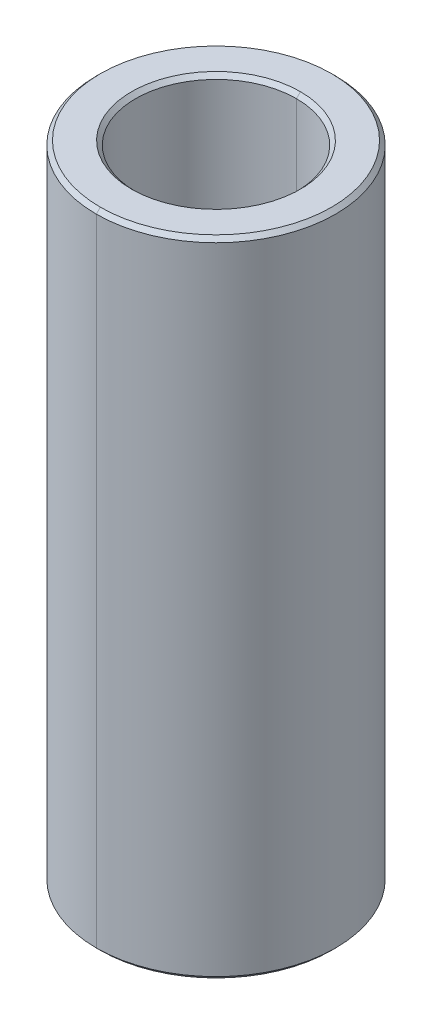
ISO-10303-21;
HEADER;
FILE_DESCRIPTION(('STEP AP214'),'2;1');
FILE_NAME('part.step','',(''),(''),'','','');
FILE_SCHEMA(('AUTOMOTIVE_DESIGN { 1 0 10303 214 1 1 1 1 }'));
ENDSEC;
DATA;
#1=APPLICATION_CONTEXT('core data for automotive mechanical design processes');
#2=APPLICATION_PROTOCOL_DEFINITION('international standard','automotive_design',2000,#1);
#3=PRODUCT_CONTEXT('',#1,'mechanical');
#4=PRODUCT('Part','Part','',(#3));
#5=PRODUCT_RELATED_PRODUCT_CATEGORY('part','',(#4));
#6=PRODUCT_DEFINITION_FORMATION('','',#4);
#7=PRODUCT_DEFINITION_CONTEXT('part definition',#1,'design');
#8=PRODUCT_DEFINITION('design','',#6,#7);
#9=PRODUCT_DEFINITION_SHAPE('','',#8);
#10=(LENGTH_UNIT() NAMED_UNIT(*) SI_UNIT(.MILLI.,.METRE.));
#11=(NAMED_UNIT(*) PLANE_ANGLE_UNIT() SI_UNIT($,.RADIAN.));
#12=(NAMED_UNIT(*) SI_UNIT($,.STERADIAN.) SOLID_ANGLE_UNIT());
#13=UNCERTAINTY_MEASURE_WITH_UNIT(LENGTH_MEASURE(1.E-05),#10,'distance_accuracy_value','');
#14=(GEOMETRIC_REPRESENTATION_CONTEXT(3) GLOBAL_UNCERTAINTY_ASSIGNED_CONTEXT((#13)) GLOBAL_UNIT_ASSIGNED_CONTEXT((#10,
#11,#12)) REPRESENTATION_CONTEXT('',''));
#15=CARTESIAN_POINT('',(0.,0.,0.));
#16=DIRECTION('',(0.,0.,1.));
#17=DIRECTION('',(1.,0.,0.));
#18=AXIS2_PLACEMENT_3D('',#15,#16,#17);
#19=CARTESIAN_POINT('',(0.,7.9,0.));
#20=DIRECTION('',(0.,1.,0.));
#21=DIRECTION('',(0.,0.,1.));
#22=AXIS2_PLACEMENT_3D('',#19,#20,#21);
#23=CONICAL_SURFACE('',#22,2.,0.78539816339744);
#24=DIRECTION('',(0.,0.707106781186554,-0.707106781186542));
#25=VECTOR('',#24,1.);
#26=CARTESIAN_POINT('',(0.,7.9,-2.));
#27=LINE('',#26,#25);
#28=CARTESIAN_POINT('',(0.,7.9,-2.));
#29=VERTEX_POINT('',#28);
#30=CARTESIAN_POINT('',(0.,8.,-2.1));
#31=VERTEX_POINT('',#30);
#32=EDGE_CURVE('E177',#29,#31,#27,.T.);
#33=ORIENTED_EDGE('',*,*,#32,.F.);
#34=CARTESIAN_POINT('',(0.,7.9,0.));
#35=DIRECTION('',(0.,1.,0.));
#36=DIRECTION('',(0.,0.,1.));
#37=AXIS2_PLACEMENT_3D('',#34,#35,#36);
#38=CIRCLE('',#37,2.);
#39=CARTESIAN_POINT('',(0.,7.9,2.));
#40=VERTEX_POINT('',#39);
#41=EDGE_CURVE('E27',#40,#29,#38,.T.);
#42=ORIENTED_EDGE('',*,*,#41,.F.);
#43=DIRECTION('',(0.,0.707106781186554,0.707106781186542));
#44=VECTOR('',#43,1.);
#45=CARTESIAN_POINT('',(0.,7.9,2.));
#46=LINE('',#45,#44);
#47=CARTESIAN_POINT('',(0.,8.,2.1));
#48=VERTEX_POINT('',#47);
#49=EDGE_CURVE('E185',#40,#48,#46,.T.);
#50=ORIENTED_EDGE('',*,*,#49,.T.);
#51=CARTESIAN_POINT('',(0.,8.,0.));
#52=DIRECTION('',(0.,-1.,0.));
#53=DIRECTION('',(0.,0.,1.));
#54=AXIS2_PLACEMENT_3D('',#51,#52,#53);
#55=CIRCLE('',#54,2.1);
#56=EDGE_CURVE('E122',#31,#48,#55,.T.);
#57=ORIENTED_EDGE('',*,*,#56,.F.);
#58=EDGE_LOOP('',(#33,#42,#50,#57));
#59=FACE_BOUND('',#58,.T.);
#60=ADVANCED_FACE('F16',(#59),#23,.F.);
#61=CARTESIAN_POINT('',(0.,-8.,0.));
#62=DIRECTION('',(0.,-1.,0.));
#63=DIRECTION('',(0.,0.,-1.));
#64=AXIS2_PLACEMENT_3D('',#61,#62,#63);
#65=CONICAL_SURFACE('',#64,2.1,0.78539816339744);
#66=DIRECTION('',(0.,-0.707106781186554,0.707106781186542));
#67=VECTOR('',#66,1.);
#68=CARTESIAN_POINT('',(0.,-8.,2.1));
#69=LINE('',#68,#67);
#70=CARTESIAN_POINT('',(0.,-7.9,2.));
#71=VERTEX_POINT('',#70);
#72=CARTESIAN_POINT('',(0.,-8.,2.1));
#73=VERTEX_POINT('',#72);
#74=EDGE_CURVE('E145',#71,#73,#69,.T.);
#75=ORIENTED_EDGE('',*,*,#74,.F.);
#76=CARTESIAN_POINT('',(0.,-7.9,0.));
#77=DIRECTION('',(0.,-1.,0.));
#78=DIRECTION('',(0.,0.,1.));
#79=AXIS2_PLACEMENT_3D('',#76,#77,#78);
#80=CIRCLE('',#79,2.);
#81=CARTESIAN_POINT('',(0.,-7.9,-2.));
#82=VERTEX_POINT('',#81);
#83=EDGE_CURVE('E10',#82,#71,#80,.T.);
#84=ORIENTED_EDGE('',*,*,#83,.F.);
#85=DIRECTION('',(0.,-0.707106781186554,-0.707106781186542));
#86=VECTOR('',#85,1.);
#87=CARTESIAN_POINT('',(0.,-8.,-2.1));
#88=LINE('',#87,#86);
#89=CARTESIAN_POINT('',(0.,-8.,-2.1));
#90=VERTEX_POINT('',#89);
#91=EDGE_CURVE('E213',#82,#90,#88,.T.);
#92=ORIENTED_EDGE('',*,*,#91,.T.);
#93=CARTESIAN_POINT('',(0.,-8.,0.));
#94=DIRECTION('',(0.,1.,0.));
#95=DIRECTION('',(0.,0.,1.));
#96=AXIS2_PLACEMENT_3D('',#93,#94,#95);
#97=CIRCLE('',#96,2.1);
#98=EDGE_CURVE('E59',#73,#90,#97,.T.);
#99=ORIENTED_EDGE('',*,*,#98,.F.);
#100=EDGE_LOOP('',(#75,#84,#92,#99));
#101=FACE_BOUND('',#100,.T.);
#102=ADVANCED_FACE('F226',(#101),#65,.F.);
#103=CARTESIAN_POINT('',(0.,8.,0.));
#104=DIRECTION('',(0.,-1.,0.));
#105=DIRECTION('',(0.,0.,-1.));
#106=AXIS2_PLACEMENT_3D('',#103,#104,#105);
#107=CONICAL_SURFACE('',#106,2.875,0.78539816339744);
#108=DIRECTION('',(0.,-0.707106781186554,0.707106781186542));
#109=VECTOR('',#108,1.);
#110=CARTESIAN_POINT('',(0.,8.,2.875));
#111=LINE('',#110,#109);
#112=CARTESIAN_POINT('',(0.,8.,2.875));
#113=VERTEX_POINT('',#112);
#114=CARTESIAN_POINT('',(0.,7.9,2.975));
#115=VERTEX_POINT('',#114);
#116=EDGE_CURVE('E155',#113,#115,#111,.T.);
#117=ORIENTED_EDGE('',*,*,#116,.F.);
#118=CARTESIAN_POINT('',(0.,8.,0.));
#119=DIRECTION('',(0.,1.,0.));
#120=DIRECTION('',(0.,0.,1.));
#121=AXIS2_PLACEMENT_3D('',#118,#119,#120);
#122=CIRCLE('',#121,2.875);
#123=CARTESIAN_POINT('',(0.,8.,-2.875));
#124=VERTEX_POINT('',#123);
#125=EDGE_CURVE('E96',#124,#113,#122,.T.);
#126=ORIENTED_EDGE('',*,*,#125,.F.);
#127=DIRECTION('',(0.,-0.707106781186554,-0.707106781186542));
#128=VECTOR('',#127,1.);
#129=CARTESIAN_POINT('',(0.,8.,-2.875));
#130=LINE('',#129,#128);
#131=CARTESIAN_POINT('',(0.,7.9,-2.975));
#132=VERTEX_POINT('',#131);
#133=EDGE_CURVE('E134',#124,#132,#130,.T.);
#134=ORIENTED_EDGE('',*,*,#133,.T.);
#135=CARTESIAN_POINT('',(0.,7.9,0.));
#136=DIRECTION('',(0.,-1.,0.));
#137=DIRECTION('',(0.,0.,1.));
#138=AXIS2_PLACEMENT_3D('',#135,#136,#137);
#139=CIRCLE('',#138,2.975);
#140=EDGE_CURVE('E88',#115,#132,#139,.T.);
#141=ORIENTED_EDGE('',*,*,#140,.F.);
#142=EDGE_LOOP('',(#117,#126,#134,#141));
#143=FACE_BOUND('',#142,.T.);
#144=ADVANCED_FACE('F260',(#143),#107,.T.);
#145=CARTESIAN_POINT('',(0.,-7.9,0.));
#146=DIRECTION('',(0.,1.,0.));
#147=DIRECTION('',(0.,0.,1.));
#148=AXIS2_PLACEMENT_3D('',#145,#146,#147);
#149=CONICAL_SURFACE('',#148,2.975,0.78539816339744);
#150=DIRECTION('',(0.,0.707106781186554,-0.707106781186542));
#151=VECTOR('',#150,1.);
#152=CARTESIAN_POINT('',(0.,-7.9,-2.975));
#153=LINE('',#152,#151);
#154=CARTESIAN_POINT('',(0.,-8.,-2.875));
#155=VERTEX_POINT('',#154);
#156=CARTESIAN_POINT('',(0.,-7.9,-2.975));
#157=VERTEX_POINT('',#156);
#158=EDGE_CURVE('E124',#155,#157,#153,.T.);
#159=ORIENTED_EDGE('',*,*,#158,.F.);
#160=CARTESIAN_POINT('',(0.,-8.,0.));
#161=DIRECTION('',(0.,-1.,0.));
#162=DIRECTION('',(0.,0.,1.));
#163=AXIS2_PLACEMENT_3D('',#160,#161,#162);
#164=CIRCLE('',#163,2.875);
#165=CARTESIAN_POINT('',(0.,-8.,2.875));
#166=VERTEX_POINT('',#165);
#167=EDGE_CURVE('E20',#166,#155,#164,.T.);
#168=ORIENTED_EDGE('',*,*,#167,.F.);
#169=DIRECTION('',(0.,0.707106781186554,0.707106781186542));
#170=VECTOR('',#169,1.);
#171=CARTESIAN_POINT('',(0.,-7.9,2.975));
#172=LINE('',#171,#170);
#173=CARTESIAN_POINT('',(0.,-7.9,2.975));
#174=VERTEX_POINT('',#173);
#175=EDGE_CURVE('E132',#166,#174,#172,.T.);
#176=ORIENTED_EDGE('',*,*,#175,.T.);
#177=CARTESIAN_POINT('',(0.,-7.9,0.));
#178=DIRECTION('',(0.,1.,0.));
#179=DIRECTION('',(0.,0.,1.));
#180=AXIS2_PLACEMENT_3D('',#177,#178,#179);
#181=CIRCLE('',#180,2.975);
#182=EDGE_CURVE('E42',#157,#174,#181,.T.);
#183=ORIENTED_EDGE('',*,*,#182,.F.);
#184=EDGE_LOOP('',(#159,#168,#176,#183));
#185=FACE_BOUND('',#184,.T.);
#186=ADVANCED_FACE('F125',(#185),#149,.T.);
#187=CARTESIAN_POINT('',(0.,8.,0.));
#188=DIRECTION('',(0.,-1.,0.));
#189=DIRECTION('',(0.,0.,-1.));
#190=AXIS2_PLACEMENT_3D('',#187,#188,#189);
#191=CYLINDRICAL_SURFACE('',#190,2.);
#192=DIRECTION('',(0.,-1.,0.));
#193=VECTOR('',#192,1.);
#194=CARTESIAN_POINT('',(0.,8.,2.));
#195=LINE('',#194,#193);
#196=EDGE_CURVE('E181',#40,#71,#195,.T.);
#197=ORIENTED_EDGE('',*,*,#196,.F.);
#198=ORIENTED_EDGE('',*,*,#41,.T.);
#199=DIRECTION('',(0.,-1.,0.));
#200=VECTOR('',#199,1.);
#201=CARTESIAN_POINT('',(0.,8.,-2.));
#202=LINE('',#201,#200);
#203=EDGE_CURVE('E150',#29,#82,#202,.T.);
#204=ORIENTED_EDGE('',*,*,#203,.T.);
#205=ORIENTED_EDGE('',*,*,#83,.T.);
#206=EDGE_LOOP('',(#197,#198,#204,#205));
#207=FACE_BOUND('',#206,.T.);
#208=ADVANCED_FACE('F240',(#207),#191,.F.);
#209=CARTESIAN_POINT('',(0.,8.,0.));
#210=DIRECTION('',(0.,-1.,0.));
#211=DIRECTION('',(0.,0.,-1.));
#212=AXIS2_PLACEMENT_3D('',#209,#210,#211);
#213=CYLINDRICAL_SURFACE('',#212,2.975);
#214=DIRECTION('',(0.,-1.,0.));
#215=VECTOR('',#214,1.);
#216=CARTESIAN_POINT('',(0.,8.,2.975));
#217=LINE('',#216,#215);
#218=EDGE_CURVE('E147',#115,#174,#217,.T.);
#219=ORIENTED_EDGE('',*,*,#218,.F.);
#220=ORIENTED_EDGE('',*,*,#140,.T.);
#221=DIRECTION('',(0.,-1.,0.));
#222=VECTOR('',#221,1.);
#223=CARTESIAN_POINT('',(0.,8.,-2.975));
#224=LINE('',#223,#222);
#225=EDGE_CURVE('E149',#132,#157,#224,.T.);
#226=ORIENTED_EDGE('',*,*,#225,.T.);
#227=ORIENTED_EDGE('',*,*,#182,.T.);
#228=EDGE_LOOP('',(#219,#220,#226,#227));
#229=FACE_BOUND('',#228,.T.);
#230=ADVANCED_FACE('F263',(#229),#213,.T.);
#231=CARTESIAN_POINT('',(0.,-8.,0.));
#232=DIRECTION('',(0.,1.,0.));
#233=DIRECTION('',(1.,0.,0.));
#234=AXIS2_PLACEMENT_3D('',#231,#232,#233);
#235=PLANE('',#234);
#236=CARTESIAN_POINT('',(0.,-8.,0.));
#237=DIRECTION('',(0.,1.,0.));
#238=DIRECTION('',(0.,0.,1.));
#239=AXIS2_PLACEMENT_3D('',#236,#237,#238);
#240=CIRCLE('',#239,2.1);
#241=EDGE_CURVE('E212',#90,#73,#240,.T.);
#242=ORIENTED_EDGE('',*,*,#241,.T.);
#243=ORIENTED_EDGE('',*,*,#98,.T.);
#244=EDGE_LOOP('',(#242,#243));
#245=FACE_BOUND('',#244,.T.);
#246=ORIENTED_EDGE('',*,*,#167,.T.);
#247=CARTESIAN_POINT('',(0.,-8.,0.));
#248=DIRECTION('',(0.,-1.,0.));
#249=DIRECTION('',(0.,0.,1.));
#250=AXIS2_PLACEMENT_3D('',#247,#248,#249);
#251=CIRCLE('',#250,2.875);
#252=EDGE_CURVE('E120',#155,#166,#251,.T.);
#253=ORIENTED_EDGE('',*,*,#252,.T.);
#254=EDGE_LOOP('',(#246,#253));
#255=FACE_BOUND('',#254,.T.);
#256=ADVANCED_FACE('F118',(#245,#255),#235,.F.);
#257=CARTESIAN_POINT('',(0.,8.,0.));
#258=DIRECTION('',(0.,1.,0.));
#259=DIRECTION('',(1.,0.,0.));
#260=AXIS2_PLACEMENT_3D('',#257,#258,#259);
#261=PLANE('',#260);
#262=CARTESIAN_POINT('',(0.,8.,0.));
#263=DIRECTION('',(0.,-1.,0.));
#264=DIRECTION('',(0.,0.,1.));
#265=AXIS2_PLACEMENT_3D('',#262,#263,#264);
#266=CIRCLE('',#265,2.1);
#267=EDGE_CURVE('E186',#48,#31,#266,.T.);
#268=ORIENTED_EDGE('',*,*,#267,.T.);
#269=ORIENTED_EDGE('',*,*,#56,.T.);
#270=EDGE_LOOP('',(#268,#269));
#271=FACE_BOUND('',#270,.T.);
#272=ORIENTED_EDGE('',*,*,#125,.T.);
#273=CARTESIAN_POINT('',(0.,8.,0.));
#274=DIRECTION('',(0.,1.,0.));
#275=DIRECTION('',(0.,0.,1.));
#276=AXIS2_PLACEMENT_3D('',#273,#274,#275);
#277=CIRCLE('',#276,2.875);
#278=EDGE_CURVE('E219',#113,#124,#277,.T.);
#279=ORIENTED_EDGE('',*,*,#278,.T.);
#280=EDGE_LOOP('',(#272,#279));
#281=FACE_BOUND('',#280,.T.);
#282=ADVANCED_FACE('F268',(#271,#281),#261,.T.);
#283=CARTESIAN_POINT('',(0.,8.,0.));
#284=DIRECTION('',(0.,-1.,0.));
#285=DIRECTION('',(0.,0.,-1.));
#286=AXIS2_PLACEMENT_3D('',#283,#284,#285);
#287=CYLINDRICAL_SURFACE('',#286,2.975);
#288=CARTESIAN_POINT('',(0.,7.9,0.));
#289=DIRECTION('',(0.,-1.,0.));
#290=DIRECTION('',(0.,0.,1.));
#291=AXIS2_PLACEMENT_3D('',#288,#289,#290);
#292=CIRCLE('',#291,2.975);
#293=EDGE_CURVE('E141',#132,#115,#292,.T.);
#294=ORIENTED_EDGE('',*,*,#293,.T.);
#295=ORIENTED_EDGE('',*,*,#218,.T.);
#296=CARTESIAN_POINT('',(0.,-7.9,0.));
#297=DIRECTION('',(0.,1.,0.));
#298=DIRECTION('',(0.,0.,1.));
#299=AXIS2_PLACEMENT_3D('',#296,#297,#298);
#300=CIRCLE('',#299,2.975);
#301=EDGE_CURVE('E129',#174,#157,#300,.T.);
#302=ORIENTED_EDGE('',*,*,#301,.T.);
#303=ORIENTED_EDGE('',*,*,#225,.F.);
#304=EDGE_LOOP('',(#294,#295,#302,#303));
#305=FACE_BOUND('',#304,.T.);
#306=ADVANCED_FACE('F271',(#305),#287,.T.);
#307=CARTESIAN_POINT('',(0.,8.,0.));
#308=DIRECTION('',(0.,-1.,0.));
#309=DIRECTION('',(0.,0.,-1.));
#310=AXIS2_PLACEMENT_3D('',#307,#308,#309);
#311=CYLINDRICAL_SURFACE('',#310,2.);
#312=CARTESIAN_POINT('',(0.,7.9,0.));
#313=DIRECTION('',(0.,1.,0.));
#314=DIRECTION('',(0.,0.,1.));
#315=AXIS2_PLACEMENT_3D('',#312,#313,#314);
#316=CIRCLE('',#315,2.);
#317=EDGE_CURVE('E194',#29,#40,#316,.T.);
#318=ORIENTED_EDGE('',*,*,#317,.T.);
#319=ORIENTED_EDGE('',*,*,#196,.T.);
#320=CARTESIAN_POINT('',(0.,-7.9,0.));
#321=DIRECTION('',(0.,-1.,0.));
#322=DIRECTION('',(0.,0.,1.));
#323=AXIS2_PLACEMENT_3D('',#320,#321,#322);
#324=CIRCLE('',#323,2.);
#325=EDGE_CURVE('E182',#71,#82,#324,.T.);
#326=ORIENTED_EDGE('',*,*,#325,.T.);
#327=ORIENTED_EDGE('',*,*,#203,.F.);
#328=EDGE_LOOP('',(#318,#319,#326,#327));
#329=FACE_BOUND('',#328,.T.);
#330=ADVANCED_FACE('F245',(#329),#311,.F.);
#331=CARTESIAN_POINT('',(0.,-7.9,0.));
#332=DIRECTION('',(0.,1.,0.));
#333=DIRECTION('',(0.,0.,1.));
#334=AXIS2_PLACEMENT_3D('',#331,#332,#333);
#335=CONICAL_SURFACE('',#334,2.975,0.78539816339744);
#336=ORIENTED_EDGE('',*,*,#252,.F.);
#337=ORIENTED_EDGE('',*,*,#158,.T.);
#338=ORIENTED_EDGE('',*,*,#301,.F.);
#339=ORIENTED_EDGE('',*,*,#175,.F.);
#340=EDGE_LOOP('',(#336,#337,#338,#339));
#341=FACE_BOUND('',#340,.T.);
#342=ADVANCED_FACE('F131',(#341),#335,.T.);
#343=CARTESIAN_POINT('',(0.,8.,0.));
#344=DIRECTION('',(0.,-1.,0.));
#345=DIRECTION('',(0.,0.,-1.));
#346=AXIS2_PLACEMENT_3D('',#343,#344,#345);
#347=CONICAL_SURFACE('',#346,2.875,0.78539816339744);
#348=ORIENTED_EDGE('',*,*,#278,.F.);
#349=ORIENTED_EDGE('',*,*,#116,.T.);
#350=ORIENTED_EDGE('',*,*,#293,.F.);
#351=ORIENTED_EDGE('',*,*,#133,.F.);
#352=EDGE_LOOP('',(#348,#349,#350,#351));
#353=FACE_BOUND('',#352,.T.);
#354=ADVANCED_FACE('F18',(#353),#347,.T.);
#355=CARTESIAN_POINT('',(0.,-8.,0.));
#356=DIRECTION('',(0.,-1.,0.));
#357=DIRECTION('',(0.,0.,-1.));
#358=AXIS2_PLACEMENT_3D('',#355,#356,#357);
#359=CONICAL_SURFACE('',#358,2.1,0.78539816339744);
#360=ORIENTED_EDGE('',*,*,#325,.F.);
#361=ORIENTED_EDGE('',*,*,#74,.T.);
#362=ORIENTED_EDGE('',*,*,#241,.F.);
#363=ORIENTED_EDGE('',*,*,#91,.F.);
#364=EDGE_LOOP('',(#360,#361,#362,#363));
#365=FACE_BOUND('',#364,.T.);
#366=ADVANCED_FACE('F224',(#365),#359,.F.);
#367=CARTESIAN_POINT('',(0.,7.9,0.));
#368=DIRECTION('',(0.,1.,0.));
#369=DIRECTION('',(0.,0.,1.));
#370=AXIS2_PLACEMENT_3D('',#367,#368,#369);
#371=CONICAL_SURFACE('',#370,2.,0.78539816339744);
#372=ORIENTED_EDGE('',*,*,#317,.F.);
#373=ORIENTED_EDGE('',*,*,#32,.T.);
#374=ORIENTED_EDGE('',*,*,#267,.F.);
#375=ORIENTED_EDGE('',*,*,#49,.F.);
#376=EDGE_LOOP('',(#372,#373,#374,#375));
#377=FACE_BOUND('',#376,.T.);
#378=ADVANCED_FACE('F246',(#377),#371,.F.);
#379=CLOSED_SHELL('',(#60,#102,#144,#186,#208,#230,#256,#282,#306,#330,#342,#354,#366,#378));
#380=MANIFOLD_SOLID_BREP('B1',#379);
#381=ADVANCED_BREP_SHAPE_REPRESENTATION('',(#18,#380),#14);
#382=SHAPE_DEFINITION_REPRESENTATION(#9,#381);
ENDSEC;
END-ISO-10303-21;
